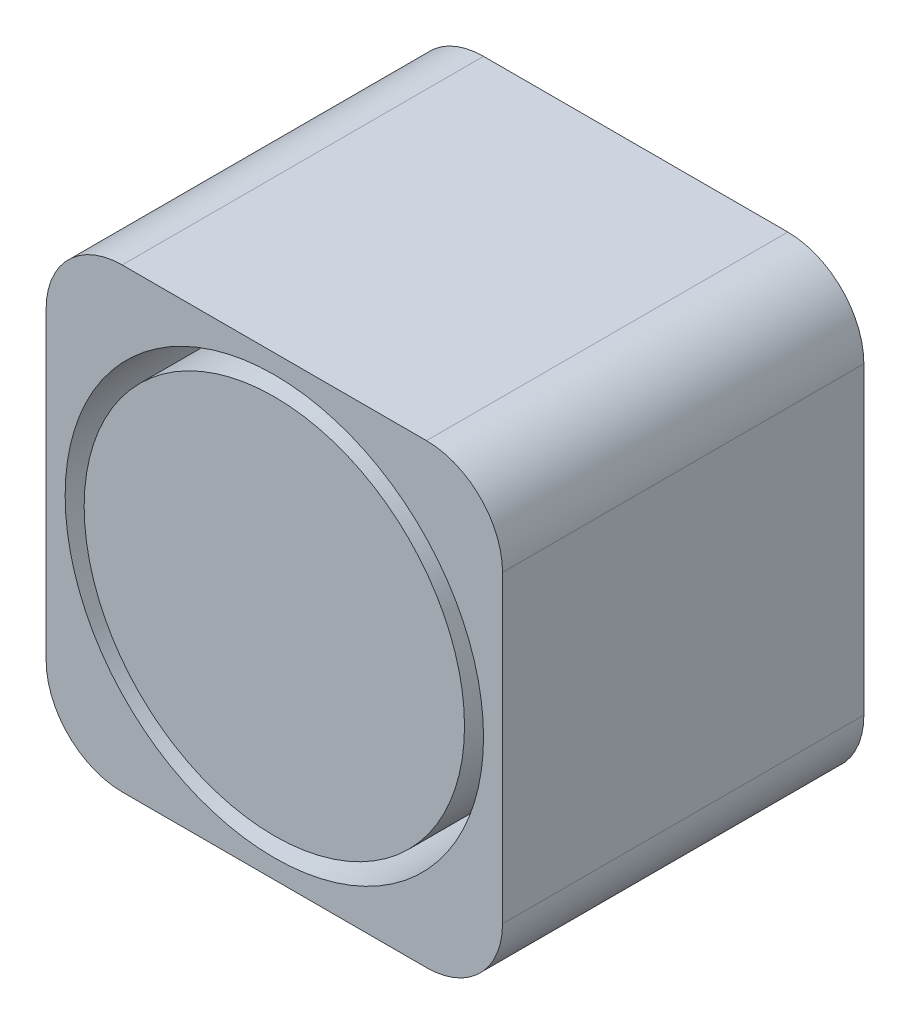
ISO-10303-21;
HEADER;
FILE_DESCRIPTION(('STEP AP214'),'2;1');
FILE_NAME('part.step','',(''),(''),'','','');
FILE_SCHEMA(('AUTOMOTIVE_DESIGN { 1 0 10303 214 1 1 1 1 }'));
ENDSEC;
DATA;
#1=APPLICATION_CONTEXT('core data for automotive mechanical design processes');
#2=APPLICATION_PROTOCOL_DEFINITION('international standard','automotive_design',2000,#1);
#3=PRODUCT_CONTEXT('',#1,'mechanical');
#4=PRODUCT('Part','Part','',(#3));
#5=PRODUCT_RELATED_PRODUCT_CATEGORY('part','',(#4));
#6=PRODUCT_DEFINITION_FORMATION('','',#4);
#7=PRODUCT_DEFINITION_CONTEXT('part definition',#1,'design');
#8=PRODUCT_DEFINITION('design','',#6,#7);
#9=PRODUCT_DEFINITION_SHAPE('','',#8);
#10=(LENGTH_UNIT() NAMED_UNIT(*) SI_UNIT(.MILLI.,.METRE.));
#11=(NAMED_UNIT(*) PLANE_ANGLE_UNIT() SI_UNIT($,.RADIAN.));
#12=(NAMED_UNIT(*) SI_UNIT($,.STERADIAN.) SOLID_ANGLE_UNIT());
#13=UNCERTAINTY_MEASURE_WITH_UNIT(LENGTH_MEASURE(1.E-05),#10,'distance_accuracy_value','');
#14=(GEOMETRIC_REPRESENTATION_CONTEXT(3) GLOBAL_UNCERTAINTY_ASSIGNED_CONTEXT((#13)) GLOBAL_UNIT_ASSIGNED_CONTEXT((#10,
#11,#12)) REPRESENTATION_CONTEXT('',''));
#15=CARTESIAN_POINT('',(0.,0.,0.));
#16=DIRECTION('',(0.,0.,1.));
#17=DIRECTION('',(1.,0.,0.));
#18=AXIS2_PLACEMENT_3D('',#15,#16,#17);
#19=CARTESIAN_POINT('',(0.,0.,9.5));
#20=DIRECTION('',(0.,0.,1.));
#21=DIRECTION('',(1.,0.,0.));
#22=AXIS2_PLACEMENT_3D('',#19,#20,#21);
#23=PLANE('',#22);
#24=CARTESIAN_POINT('',(0.,0.,9.5));
#25=DIRECTION('',(0.,0.,-1.));
#26=DIRECTION('',(-1.,0.,0.));
#27=AXIS2_PLACEMENT_3D('',#24,#25,#26);
#28=CIRCLE('',#27,5.);
#29=CARTESIAN_POINT('',(-5.,0.,9.5));
#30=VERTEX_POINT('',#29);
#31=EDGE_CURVE('E19',#30,#30,#28,.T.);
#32=ORIENTED_EDGE('',*,*,#31,.F.);
#33=EDGE_LOOP('',(#32));
#34=FACE_BOUND('',#33,.T.);
#35=ADVANCED_FACE('F16',(#34),#23,.T.);
#36=CARTESIAN_POINT('',(0.,0.,0.));
#37=DIRECTION('',(0.,0.,1.));
#38=DIRECTION('',(1.,0.,0.));
#39=AXIS2_PLACEMENT_3D('',#36,#37,#38);
#40=PLANE('',#39);
#41=CARTESIAN_POINT('',(4.,4.,0.));
#42=DIRECTION('',(0.,0.,1.));
#43=DIRECTION('',(1.,0.,0.));
#44=AXIS2_PLACEMENT_3D('',#41,#42,#43);
#45=CIRCLE('',#44,1.99999999999999);
#46=CARTESIAN_POINT('',(5.99999999999999,4.,0.));
#47=VERTEX_POINT('',#46);
#48=CARTESIAN_POINT('',(4.,5.99999999999999,0.));
#49=VERTEX_POINT('',#48);
#50=EDGE_CURVE('E128',#47,#49,#45,.T.);
#51=ORIENTED_EDGE('',*,*,#50,.F.);
#52=DIRECTION('',(0.,1.,0.));
#53=VECTOR('',#52,1.);
#54=CARTESIAN_POINT('',(6.,-4.,0.));
#55=LINE('',#54,#53);
#56=CARTESIAN_POINT('',(6.,-4.,0.));
#57=VERTEX_POINT('',#56);
#58=EDGE_CURVE('E145',#57,#47,#55,.T.);
#59=ORIENTED_EDGE('',*,*,#58,.F.);
#60=CARTESIAN_POINT('',(4.,-4.,0.));
#61=DIRECTION('',(0.,0.,1.));
#62=DIRECTION('',(1.,0.,0.));
#63=AXIS2_PLACEMENT_3D('',#60,#61,#62);
#64=CIRCLE('',#63,2.);
#65=CARTESIAN_POINT('',(4.,-6.,0.));
#66=VERTEX_POINT('',#65);
#67=EDGE_CURVE('E132',#66,#57,#64,.T.);
#68=ORIENTED_EDGE('',*,*,#67,.F.);
#69=DIRECTION('',(1.,0.,0.));
#70=VECTOR('',#69,1.);
#71=CARTESIAN_POINT('',(-4.,-6.,0.));
#72=LINE('',#71,#70);
#73=CARTESIAN_POINT('',(-4.,-6.,0.));
#74=VERTEX_POINT('',#73);
#75=EDGE_CURVE('E109',#74,#66,#72,.T.);
#76=ORIENTED_EDGE('',*,*,#75,.F.);
#77=CARTESIAN_POINT('',(-4.,-4.,0.));
#78=DIRECTION('',(0.,0.,1.));
#79=DIRECTION('',(1.,0.,0.));
#80=AXIS2_PLACEMENT_3D('',#77,#78,#79);
#81=CIRCLE('',#80,2.);
#82=CARTESIAN_POINT('',(-6.,-4.,0.));
#83=VERTEX_POINT('',#82);
#84=EDGE_CURVE('E100',#83,#74,#81,.T.);
#85=ORIENTED_EDGE('',*,*,#84,.F.);
#86=DIRECTION('',(0.,1.,0.));
#87=VECTOR('',#86,1.);
#88=CARTESIAN_POINT('',(-6.,4.,0.));
#89=LINE('',#88,#87);
#90=CARTESIAN_POINT('',(-6.,4.,0.));
#91=VERTEX_POINT('',#90);
#92=EDGE_CURVE('E97',#91,#83,#89,.F.);
#93=ORIENTED_EDGE('',*,*,#92,.F.);
#94=CARTESIAN_POINT('',(-4.,4.,0.));
#95=DIRECTION('',(0.,0.,1.));
#96=DIRECTION('',(1.,0.,0.));
#97=AXIS2_PLACEMENT_3D('',#94,#95,#96);
#98=CIRCLE('',#97,2.);
#99=CARTESIAN_POINT('',(-4.,6.,0.));
#100=VERTEX_POINT('',#99);
#101=EDGE_CURVE('E85',#100,#91,#98,.T.);
#102=ORIENTED_EDGE('',*,*,#101,.F.);
#103=DIRECTION('',(1.,0.,0.));
#104=VECTOR('',#103,1.);
#105=CARTESIAN_POINT('',(4.,6.,0.));
#106=LINE('',#105,#104);
#107=EDGE_CURVE('E79',#49,#100,#106,.F.);
#108=ORIENTED_EDGE('',*,*,#107,.F.);
#109=EDGE_LOOP('',(#51,#59,#68,#76,#85,#93,#102,#108));
#110=FACE_BOUND('',#109,.T.);
#111=ADVANCED_FACE('F104',(#110),#40,.F.);
#112=CARTESIAN_POINT('',(0.,0.,9.5));
#113=DIRECTION('',(0.,0.,-1.));
#114=DIRECTION('',(-1.,0.,0.));
#115=AXIS2_PLACEMENT_3D('',#112,#113,#114);
#116=CYLINDRICAL_SURFACE('',#115,5.);
#117=ORIENTED_EDGE('',*,*,#31,.T.);
#118=EDGE_LOOP('',(#117));
#119=FACE_BOUND('',#118,.T.);
#120=CARTESIAN_POINT('',(0.,0.,4.5));
#121=DIRECTION('',(0.,0.,-1.));
#122=DIRECTION('',(-1.,0.,0.));
#123=AXIS2_PLACEMENT_3D('',#120,#121,#122);
#124=CIRCLE('',#123,5.);
#125=CARTESIAN_POINT('',(-5.,0.,4.5));
#126=VERTEX_POINT('',#125);
#127=EDGE_CURVE('E124',#126,#126,#124,.T.);
#128=ORIENTED_EDGE('',*,*,#127,.F.);
#129=EDGE_LOOP('',(#128));
#130=FACE_BOUND('',#129,.T.);
#131=ADVANCED_FACE('F149',(#119,#130),#116,.T.);
#132=CARTESIAN_POINT('',(4.,6.,0.));
#133=DIRECTION('',(0.,1.,0.));
#134=DIRECTION('',(0.,0.,1.));
#135=AXIS2_PLACEMENT_3D('',#132,#133,#134);
#136=PLANE('',#135);
#137=DIRECTION('',(1.,0.,0.));
#138=VECTOR('',#137,1.);
#139=CARTESIAN_POINT('',(0.,6.,9.5));
#140=LINE('',#139,#138);
#141=CARTESIAN_POINT('',(4.,5.99999999999999,9.5));
#142=VERTEX_POINT('',#141);
#143=CARTESIAN_POINT('',(-4.,6.,9.5));
#144=VERTEX_POINT('',#143);
#145=EDGE_CURVE('E123',#142,#144,#140,.F.);
#146=ORIENTED_EDGE('',*,*,#145,.F.);
#147=DIRECTION('',(0.,0.,1.));
#148=VECTOR('',#147,1.);
#149=CARTESIAN_POINT('',(4.,5.99999999999999,0.));
#150=LINE('',#149,#148);
#151=EDGE_CURVE('E130',#49,#142,#150,.T.);
#152=ORIENTED_EDGE('',*,*,#151,.F.);
#153=ORIENTED_EDGE('',*,*,#107,.T.);
#154=DIRECTION('',(0.,0.,1.));
#155=VECTOR('',#154,1.);
#156=CARTESIAN_POINT('',(-4.,6.,0.));
#157=LINE('',#156,#155);
#158=EDGE_CURVE('E91',#144,#100,#157,.F.);
#159=ORIENTED_EDGE('',*,*,#158,.F.);
#160=EDGE_LOOP('',(#146,#152,#153,#159));
#161=FACE_BOUND('',#160,.T.);
#162=ADVANCED_FACE('F197',(#161),#136,.T.);
#163=CARTESIAN_POINT('',(-4.,4.,0.));
#164=DIRECTION('',(0.,0.,1.));
#165=DIRECTION('',(1.,0.,0.));
#166=AXIS2_PLACEMENT_3D('',#163,#164,#165);
#167=CYLINDRICAL_SURFACE('',#166,2.);
#168=CARTESIAN_POINT('',(-4.,4.,9.5));
#169=DIRECTION('',(0.,0.,1.));
#170=DIRECTION('',(1.,0.,0.));
#171=AXIS2_PLACEMENT_3D('',#168,#169,#170);
#172=CIRCLE('',#171,2.);
#173=CARTESIAN_POINT('',(-6.,4.,9.5));
#174=VERTEX_POINT('',#173);
#175=EDGE_CURVE('E121',#144,#174,#172,.T.);
#176=ORIENTED_EDGE('',*,*,#175,.F.);
#177=ORIENTED_EDGE('',*,*,#158,.T.);
#178=ORIENTED_EDGE('',*,*,#101,.T.);
#179=DIRECTION('',(0.,0.,1.));
#180=VECTOR('',#179,1.);
#181=CARTESIAN_POINT('',(-6.,4.,0.));
#182=LINE('',#181,#180);
#183=EDGE_CURVE('E89',#174,#91,#182,.F.);
#184=ORIENTED_EDGE('',*,*,#183,.F.);
#185=EDGE_LOOP('',(#176,#177,#178,#184));
#186=FACE_BOUND('',#185,.T.);
#187=ADVANCED_FACE('F88',(#186),#167,.T.);
#188=CARTESIAN_POINT('',(-6.,4.,0.));
#189=DIRECTION('',(-1.,0.,0.));
#190=DIRECTION('',(0.,0.,1.));
#191=AXIS2_PLACEMENT_3D('',#188,#189,#190);
#192=PLANE('',#191);
#193=DIRECTION('',(0.,1.,0.));
#194=VECTOR('',#193,1.);
#195=CARTESIAN_POINT('',(-6.,0.,9.5));
#196=LINE('',#195,#194);
#197=CARTESIAN_POINT('',(-6.,-4.,9.5));
#198=VERTEX_POINT('',#197);
#199=EDGE_CURVE('E99',#174,#198,#196,.F.);
#200=ORIENTED_EDGE('',*,*,#199,.F.);
#201=ORIENTED_EDGE('',*,*,#183,.T.);
#202=ORIENTED_EDGE('',*,*,#92,.T.);
#203=DIRECTION('',(0.,0.,1.));
#204=VECTOR('',#203,1.);
#205=CARTESIAN_POINT('',(-6.,-4.,0.));
#206=LINE('',#205,#204);
#207=EDGE_CURVE('E136',#198,#83,#206,.F.);
#208=ORIENTED_EDGE('',*,*,#207,.F.);
#209=EDGE_LOOP('',(#200,#201,#202,#208));
#210=FACE_BOUND('',#209,.T.);
#211=ADVANCED_FACE('F95',(#210),#192,.T.);
#212=CARTESIAN_POINT('',(-4.,-4.,0.));
#213=DIRECTION('',(0.,0.,1.));
#214=DIRECTION('',(1.,0.,0.));
#215=AXIS2_PLACEMENT_3D('',#212,#213,#214);
#216=CYLINDRICAL_SURFACE('',#215,2.);
#217=CARTESIAN_POINT('',(-4.,-4.,9.5));
#218=DIRECTION('',(0.,0.,1.));
#219=DIRECTION('',(1.,0.,0.));
#220=AXIS2_PLACEMENT_3D('',#217,#218,#219);
#221=CIRCLE('',#220,2.);
#222=CARTESIAN_POINT('',(-4.,-6.,9.5));
#223=VERTEX_POINT('',#222);
#224=EDGE_CURVE('E119',#198,#223,#221,.T.);
#225=ORIENTED_EDGE('',*,*,#224,.F.);
#226=ORIENTED_EDGE('',*,*,#207,.T.);
#227=ORIENTED_EDGE('',*,*,#84,.T.);
#228=DIRECTION('',(0.,0.,-1.));
#229=VECTOR('',#228,1.);
#230=CARTESIAN_POINT('',(-4.,-6.,0.));
#231=LINE('',#230,#229);
#232=EDGE_CURVE('E135',#223,#74,#231,.T.);
#233=ORIENTED_EDGE('',*,*,#232,.F.);
#234=EDGE_LOOP('',(#225,#226,#227,#233));
#235=FACE_BOUND('',#234,.T.);
#236=ADVANCED_FACE('F189',(#235),#216,.T.);
#237=CARTESIAN_POINT('',(-4.,-6.,0.));
#238=DIRECTION('',(0.,-1.,0.));
#239=DIRECTION('',(0.,0.,-1.));
#240=AXIS2_PLACEMENT_3D('',#237,#238,#239);
#241=PLANE('',#240);
#242=DIRECTION('',(1.,0.,0.));
#243=VECTOR('',#242,1.);
#244=CARTESIAN_POINT('',(0.,-6.,9.5));
#245=LINE('',#244,#243);
#246=CARTESIAN_POINT('',(4.,-6.,9.5));
#247=VERTEX_POINT('',#246);
#248=EDGE_CURVE('E118',#223,#247,#245,.T.);
#249=ORIENTED_EDGE('',*,*,#248,.F.);
#250=ORIENTED_EDGE('',*,*,#232,.T.);
#251=ORIENTED_EDGE('',*,*,#75,.T.);
#252=DIRECTION('',(0.,0.,1.));
#253=VECTOR('',#252,1.);
#254=CARTESIAN_POINT('',(4.,-6.,0.));
#255=LINE('',#254,#253);
#256=EDGE_CURVE('E134',#247,#66,#255,.F.);
#257=ORIENTED_EDGE('',*,*,#256,.F.);
#258=EDGE_LOOP('',(#249,#250,#251,#257));
#259=FACE_BOUND('',#258,.T.);
#260=ADVANCED_FACE('F185',(#259),#241,.T.);
#261=CARTESIAN_POINT('',(4.,-4.,0.));
#262=DIRECTION('',(0.,0.,1.));
#263=DIRECTION('',(1.,0.,0.));
#264=AXIS2_PLACEMENT_3D('',#261,#262,#263);
#265=CYLINDRICAL_SURFACE('',#264,2.);
#266=CARTESIAN_POINT('',(4.,-4.,9.5));
#267=DIRECTION('',(0.,0.,1.));
#268=DIRECTION('',(1.,0.,0.));
#269=AXIS2_PLACEMENT_3D('',#266,#267,#268);
#270=CIRCLE('',#269,2.);
#271=CARTESIAN_POINT('',(6.,-4.,9.5));
#272=VERTEX_POINT('',#271);
#273=EDGE_CURVE('E116',#247,#272,#270,.T.);
#274=ORIENTED_EDGE('',*,*,#273,.F.);
#275=ORIENTED_EDGE('',*,*,#256,.T.);
#276=ORIENTED_EDGE('',*,*,#67,.T.);
#277=DIRECTION('',(0.,0.,-1.));
#278=VECTOR('',#277,1.);
#279=CARTESIAN_POINT('',(6.,-4.,0.));
#280=LINE('',#279,#278);
#281=EDGE_CURVE('E131',#272,#57,#280,.T.);
#282=ORIENTED_EDGE('',*,*,#281,.F.);
#283=EDGE_LOOP('',(#274,#275,#276,#282));
#284=FACE_BOUND('',#283,.T.);
#285=ADVANCED_FACE('F181',(#284),#265,.T.);
#286=CARTESIAN_POINT('',(6.,-4.,0.));
#287=DIRECTION('',(1.,0.,0.));
#288=DIRECTION('',(0.,0.,-1.));
#289=AXIS2_PLACEMENT_3D('',#286,#287,#288);
#290=PLANE('',#289);
#291=DIRECTION('',(0.,1.,0.));
#292=VECTOR('',#291,1.);
#293=CARTESIAN_POINT('',(6.,0.,9.5));
#294=LINE('',#293,#292);
#295=CARTESIAN_POINT('',(5.99999999999999,4.,9.5));
#296=VERTEX_POINT('',#295);
#297=EDGE_CURVE('E34',#272,#296,#294,.T.);
#298=ORIENTED_EDGE('',*,*,#297,.F.);
#299=ORIENTED_EDGE('',*,*,#281,.T.);
#300=ORIENTED_EDGE('',*,*,#58,.T.);
#301=DIRECTION('',(0.,0.,1.));
#302=VECTOR('',#301,1.);
#303=CARTESIAN_POINT('',(5.99999999999999,4.,0.));
#304=LINE('',#303,#302);
#305=EDGE_CURVE('E127',#296,#47,#304,.F.);
#306=ORIENTED_EDGE('',*,*,#305,.F.);
#307=EDGE_LOOP('',(#298,#299,#300,#306));
#308=FACE_BOUND('',#307,.T.);
#309=ADVANCED_FACE('F177',(#308),#290,.T.);
#310=CARTESIAN_POINT('',(4.,4.,0.));
#311=DIRECTION('',(0.,0.,1.));
#312=DIRECTION('',(1.,0.,0.));
#313=AXIS2_PLACEMENT_3D('',#310,#311,#312);
#314=CYLINDRICAL_SURFACE('',#313,1.99999999999999);
#315=CARTESIAN_POINT('',(4.,4.,9.5));
#316=DIRECTION('',(0.,0.,1.));
#317=DIRECTION('',(1.,0.,0.));
#318=AXIS2_PLACEMENT_3D('',#315,#316,#317);
#319=CIRCLE('',#318,1.99999999999999);
#320=EDGE_CURVE('E114',#296,#142,#319,.T.);
#321=ORIENTED_EDGE('',*,*,#320,.F.);
#322=ORIENTED_EDGE('',*,*,#305,.T.);
#323=ORIENTED_EDGE('',*,*,#50,.T.);
#324=ORIENTED_EDGE('',*,*,#151,.T.);
#325=EDGE_LOOP('',(#321,#322,#323,#324));
#326=FACE_BOUND('',#325,.T.);
#327=ADVANCED_FACE('F173',(#326),#314,.T.);
#328=CARTESIAN_POINT('',(0.,0.,4.5));
#329=DIRECTION('',(0.,0.,1.));
#330=DIRECTION('',(1.,0.,0.));
#331=AXIS2_PLACEMENT_3D('',#328,#329,#330);
#332=PLANE('',#331);
#333=ORIENTED_EDGE('',*,*,#127,.T.);
#334=EDGE_LOOP('',(#333));
#335=FACE_BOUND('',#334,.T.);
#336=CARTESIAN_POINT('',(0.,0.,4.5));
#337=DIRECTION('',(0.,0.,-1.));
#338=DIRECTION('',(-1.,0.,0.));
#339=AXIS2_PLACEMENT_3D('',#336,#337,#338);
#340=CIRCLE('',#339,5.5);
#341=CARTESIAN_POINT('',(-5.5,0.,4.5));
#342=VERTEX_POINT('',#341);
#343=EDGE_CURVE('E25',#342,#342,#340,.F.);
#344=ORIENTED_EDGE('',*,*,#343,.T.);
#345=EDGE_LOOP('',(#344));
#346=FACE_BOUND('',#345,.T.);
#347=ADVANCED_FACE('F165',(#335,#346),#332,.T.);
#348=CARTESIAN_POINT('',(0.,0.,9.5));
#349=DIRECTION('',(0.,0.,1.));
#350=DIRECTION('',(1.,0.,0.));
#351=AXIS2_PLACEMENT_3D('',#348,#349,#350);
#352=PLANE('',#351);
#353=CARTESIAN_POINT('',(0.,0.,9.5));
#354=DIRECTION('',(0.,0.,-1.));
#355=DIRECTION('',(-1.,0.,0.));
#356=AXIS2_PLACEMENT_3D('',#353,#354,#355);
#357=CIRCLE('',#356,5.5);
#358=CARTESIAN_POINT('',(-5.5,0.,9.5));
#359=VERTEX_POINT('',#358);
#360=EDGE_CURVE('E11',#359,#359,#357,.T.);
#361=ORIENTED_EDGE('',*,*,#360,.T.);
#362=EDGE_LOOP('',(#361));
#363=FACE_BOUND('',#362,.T.);
#364=ORIENTED_EDGE('',*,*,#297,.T.);
#365=ORIENTED_EDGE('',*,*,#320,.T.);
#366=ORIENTED_EDGE('',*,*,#145,.T.);
#367=ORIENTED_EDGE('',*,*,#175,.T.);
#368=ORIENTED_EDGE('',*,*,#199,.T.);
#369=ORIENTED_EDGE('',*,*,#224,.T.);
#370=ORIENTED_EDGE('',*,*,#248,.T.);
#371=ORIENTED_EDGE('',*,*,#273,.T.);
#372=EDGE_LOOP('',(#364,#365,#366,#367,#368,#369,#370,#371));
#373=FACE_BOUND('',#372,.T.);
#374=ADVANCED_FACE('F159',(#363,#373),#352,.T.);
#375=CARTESIAN_POINT('',(0.,0.,9.5));
#376=DIRECTION('',(0.,0.,-1.));
#377=DIRECTION('',(-1.,0.,0.));
#378=AXIS2_PLACEMENT_3D('',#375,#376,#377);
#379=CYLINDRICAL_SURFACE('',#378,5.5);
#380=ORIENTED_EDGE('',*,*,#360,.F.);
#381=EDGE_LOOP('',(#380));
#382=FACE_BOUND('',#381,.T.);
#383=ORIENTED_EDGE('',*,*,#343,.F.);
#384=EDGE_LOOP('',(#383));
#385=FACE_BOUND('',#384,.T.);
#386=ADVANCED_FACE('F157',(#382,#385),#379,.F.);
#387=CLOSED_SHELL('',(#35,#111,#131,#162,#187,#211,#236,#260,#285,#309,#327,#347,#374,#386));
#388=MANIFOLD_SOLID_BREP('B1',#387);
#389=ADVANCED_BREP_SHAPE_REPRESENTATION('',(#18,#388),#14);
#390=SHAPE_DEFINITION_REPRESENTATION(#9,#389);
ENDSEC;
END-ISO-10303-21;
